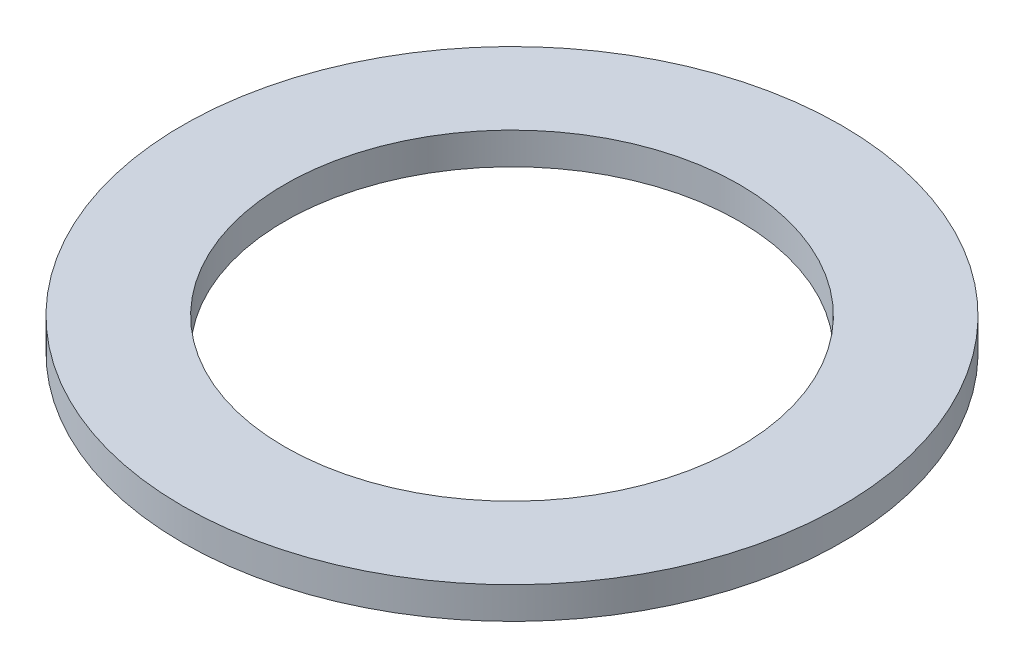
ISO-10303-21;
HEADER;
FILE_DESCRIPTION(('STEP AP214'),'2;1');
FILE_NAME('part.step','',(''),(''),'','','');
FILE_SCHEMA(('AUTOMOTIVE_DESIGN { 1 0 10303 214 1 1 1 1 }'));
ENDSEC;
DATA;
#1=APPLICATION_CONTEXT('core data for automotive mechanical design processes');
#2=APPLICATION_PROTOCOL_DEFINITION('international standard','automotive_design',2000,#1);
#3=PRODUCT_CONTEXT('',#1,'mechanical');
#4=PRODUCT('Part','Part','',(#3));
#5=PRODUCT_RELATED_PRODUCT_CATEGORY('part','',(#4));
#6=PRODUCT_DEFINITION_FORMATION('','',#4);
#7=PRODUCT_DEFINITION_CONTEXT('part definition',#1,'design');
#8=PRODUCT_DEFINITION('design','',#6,#7);
#9=PRODUCT_DEFINITION_SHAPE('','',#8);
#10=(LENGTH_UNIT() NAMED_UNIT(*) SI_UNIT(.MILLI.,.METRE.));
#11=(NAMED_UNIT(*) PLANE_ANGLE_UNIT() SI_UNIT($,.RADIAN.));
#12=(NAMED_UNIT(*) SI_UNIT($,.STERADIAN.) SOLID_ANGLE_UNIT());
#13=UNCERTAINTY_MEASURE_WITH_UNIT(LENGTH_MEASURE(1.E-05),#10,'distance_accuracy_value','');
#14=(GEOMETRIC_REPRESENTATION_CONTEXT(3) GLOBAL_UNCERTAINTY_ASSIGNED_CONTEXT((#13)) GLOBAL_UNIT_ASSIGNED_CONTEXT((#10,
#11,#12)) REPRESENTATION_CONTEXT('',''));
#15=CARTESIAN_POINT('',(0.,0.,0.));
#16=DIRECTION('',(0.,0.,1.));
#17=DIRECTION('',(1.,0.,0.));
#18=AXIS2_PLACEMENT_3D('',#15,#16,#17);
#19=CARTESIAN_POINT('',(0.,7.,0.));
#20=DIRECTION('',(0.,-1.,0.));
#21=DIRECTION('',(0.,0.,-1.));
#22=AXIS2_PLACEMENT_3D('',#19,#20,#21);
#23=CYLINDRICAL_SURFACE('',#22,72.5);
#24=CARTESIAN_POINT('',(0.,7.,0.));
#25=DIRECTION('',(0.,1.,0.));
#26=DIRECTION('',(0.,0.,1.));
#27=AXIS2_PLACEMENT_3D('',#24,#25,#26);
#28=CIRCLE('',#27,72.5);
#29=CARTESIAN_POINT('',(0.,7.,72.5));
#30=VERTEX_POINT('',#29);
#31=EDGE_CURVE('E10',#30,#30,#28,.T.);
#32=ORIENTED_EDGE('',*,*,#31,.F.);
#33=EDGE_LOOP('',(#32));
#34=FACE_BOUND('',#33,.T.);
#35=CARTESIAN_POINT('',(0.,0.,0.));
#36=DIRECTION('',(0.,1.,0.));
#37=DIRECTION('',(0.,0.,1.));
#38=AXIS2_PLACEMENT_3D('',#35,#36,#37);
#39=CIRCLE('',#38,72.5);
#40=CARTESIAN_POINT('',(0.,0.,72.5));
#41=VERTEX_POINT('',#40);
#42=EDGE_CURVE('E37',#41,#41,#39,.T.);
#43=ORIENTED_EDGE('',*,*,#42,.T.);
#44=EDGE_LOOP('',(#43));
#45=FACE_BOUND('',#44,.T.);
#46=ADVANCED_FACE('F40',(#34,#45),#23,.T.);
#47=CARTESIAN_POINT('',(0.,7.,0.));
#48=DIRECTION('',(0.,1.,0.));
#49=DIRECTION('',(0.,0.,1.));
#50=AXIS2_PLACEMENT_3D('',#47,#48,#49);
#51=PLANE('',#50);
#52=CARTESIAN_POINT('',(0.,7.,0.));
#53=DIRECTION('',(0.,1.,0.));
#54=DIRECTION('',(0.,0.,1.));
#55=AXIS2_PLACEMENT_3D('',#52,#53,#54);
#56=CIRCLE('',#55,50.);
#57=CARTESIAN_POINT('',(0.,7.,50.));
#58=VERTEX_POINT('',#57);
#59=EDGE_CURVE('E50',#58,#58,#56,.T.);
#60=ORIENTED_EDGE('',*,*,#59,.F.);
#61=EDGE_LOOP('',(#60));
#62=FACE_BOUND('',#61,.T.);
#63=ORIENTED_EDGE('',*,*,#31,.T.);
#64=EDGE_LOOP('',(#63));
#65=FACE_BOUND('',#64,.T.);
#66=ADVANCED_FACE('F59',(#62,#65),#51,.T.);
#67=CARTESIAN_POINT('',(0.,0.,0.));
#68=DIRECTION('',(0.,1.,0.));
#69=DIRECTION('',(0.,0.,1.));
#70=AXIS2_PLACEMENT_3D('',#67,#68,#69);
#71=PLANE('',#70);
#72=CARTESIAN_POINT('',(0.,0.,0.));
#73=DIRECTION('',(0.,1.,0.));
#74=DIRECTION('',(0.,0.,1.));
#75=AXIS2_PLACEMENT_3D('',#72,#73,#74);
#76=CIRCLE('',#75,50.);
#77=CARTESIAN_POINT('',(0.,0.,50.));
#78=VERTEX_POINT('',#77);
#79=EDGE_CURVE('E47',#78,#78,#76,.T.);
#80=ORIENTED_EDGE('',*,*,#79,.T.);
#81=EDGE_LOOP('',(#80));
#82=FACE_BOUND('',#81,.T.);
#83=ORIENTED_EDGE('',*,*,#42,.F.);
#84=EDGE_LOOP('',(#83));
#85=FACE_BOUND('',#84,.T.);
#86=ADVANCED_FACE('F58',(#82,#85),#71,.F.);
#87=CARTESIAN_POINT('',(0.,7.,0.));
#88=DIRECTION('',(0.,-1.,0.));
#89=DIRECTION('',(0.,0.,-1.));
#90=AXIS2_PLACEMENT_3D('',#87,#88,#89);
#91=CYLINDRICAL_SURFACE('',#90,50.);
#92=ORIENTED_EDGE('',*,*,#59,.T.);
#93=EDGE_LOOP('',(#92));
#94=FACE_BOUND('',#93,.T.);
#95=ORIENTED_EDGE('',*,*,#79,.F.);
#96=EDGE_LOOP('',(#95));
#97=FACE_BOUND('',#96,.T.);
#98=ADVANCED_FACE('F54',(#94,#97),#91,.F.);
#99=CLOSED_SHELL('',(#46,#66,#86,#98));
#100=MANIFOLD_SOLID_BREP('B2',#99);
#101=ADVANCED_BREP_SHAPE_REPRESENTATION('',(#18,#100),#14);
#102=SHAPE_DEFINITION_REPRESENTATION(#9,#101);
ENDSEC;
END-ISO-10303-21;
